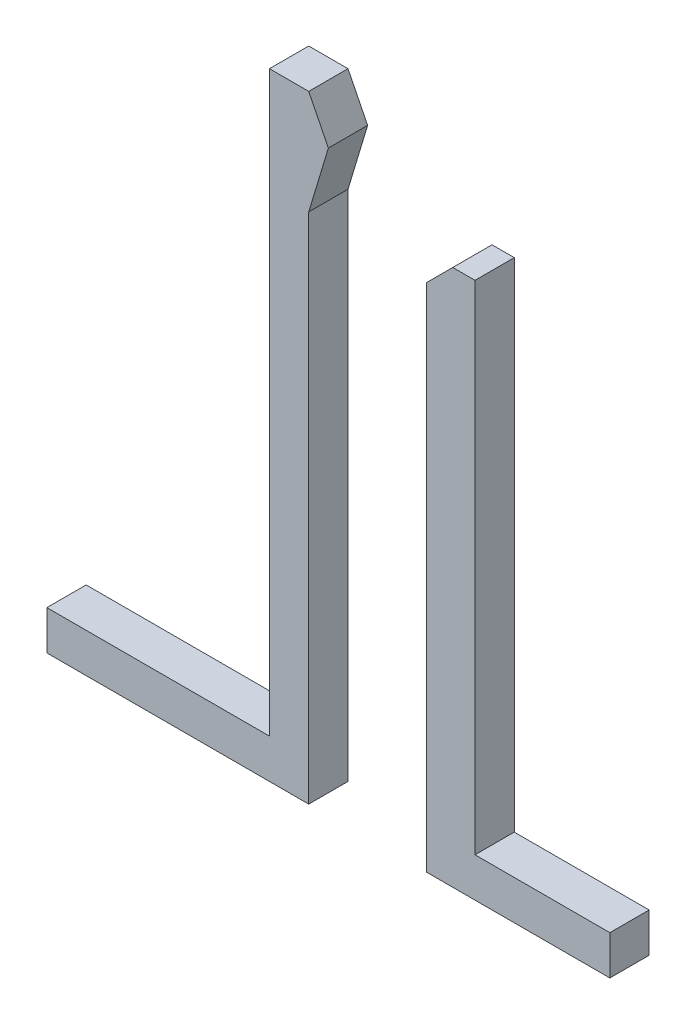
ISO-10303-21;
HEADER;
FILE_DESCRIPTION(('STEP AP214'),'2;1');
FILE_NAME('part.step','',(''),(''),'','','');
FILE_SCHEMA(('AUTOMOTIVE_DESIGN { 1 0 10303 214 1 1 1 1 }'));
ENDSEC;
DATA;
#1=APPLICATION_CONTEXT('core data for automotive mechanical design processes');
#2=APPLICATION_PROTOCOL_DEFINITION('international standard','automotive_design',2000,#1);
#3=PRODUCT_CONTEXT('',#1,'mechanical');
#4=PRODUCT('Part','Part','',(#3));
#5=PRODUCT_RELATED_PRODUCT_CATEGORY('part','',(#4));
#6=PRODUCT_DEFINITION_FORMATION('','',#4);
#7=PRODUCT_DEFINITION_CONTEXT('part definition',#1,'design');
#8=PRODUCT_DEFINITION('design','',#6,#7);
#9=PRODUCT_DEFINITION_SHAPE('','',#8);
#10=(LENGTH_UNIT() NAMED_UNIT(*) SI_UNIT(.MILLI.,.METRE.));
#11=(NAMED_UNIT(*) PLANE_ANGLE_UNIT() SI_UNIT($,.RADIAN.));
#12=(NAMED_UNIT(*) SI_UNIT($,.STERADIAN.) SOLID_ANGLE_UNIT());
#13=UNCERTAINTY_MEASURE_WITH_UNIT(LENGTH_MEASURE(1.E-05),#10,'distance_accuracy_value','');
#14=(GEOMETRIC_REPRESENTATION_CONTEXT(3) GLOBAL_UNCERTAINTY_ASSIGNED_CONTEXT((#13)) GLOBAL_UNIT_ASSIGNED_CONTEXT((#10,
#11,#12)) REPRESENTATION_CONTEXT('',''));
#15=CARTESIAN_POINT('',(0.,0.,0.));
#16=DIRECTION('',(0.,0.,1.));
#17=DIRECTION('',(1.,0.,0.));
#18=AXIS2_PLACEMENT_3D('',#15,#16,#17);
#19=CARTESIAN_POINT('',(1.95,0.2,0.3));
#20=DIRECTION('',(-1.,0.,0.));
#21=DIRECTION('',(0.,0.,1.));
#22=AXIS2_PLACEMENT_3D('',#19,#20,#21);
#23=PLANE('',#22);
#24=DIRECTION('',(0.,1.,0.));
#25=VECTOR('',#24,1.);
#26=CARTESIAN_POINT('',(1.95,0.2,0.));
#27=LINE('',#26,#25);
#28=CARTESIAN_POINT('',(1.95,-0.1,0.));
#29=VERTEX_POINT('',#28);
#30=CARTESIAN_POINT('',(1.95,0.2,0.));
#31=VERTEX_POINT('',#30);
#32=EDGE_CURVE('E134',#29,#31,#27,.T.);
#33=ORIENTED_EDGE('',*,*,#32,.T.);
#34=DIRECTION('',(0.,0.,-1.));
#35=VECTOR('',#34,1.);
#36=CARTESIAN_POINT('',(1.95,0.2,0.3));
#37=LINE('',#36,#35);
#38=CARTESIAN_POINT('',(1.95,0.2,0.3));
#39=VERTEX_POINT('',#38);
#40=EDGE_CURVE('E12',#39,#31,#37,.T.);
#41=ORIENTED_EDGE('',*,*,#40,.F.);
#42=DIRECTION('',(0.,1.,0.));
#43=VECTOR('',#42,1.);
#44=CARTESIAN_POINT('',(1.95,0.2,0.3));
#45=LINE('',#44,#43);
#46=CARTESIAN_POINT('',(1.95,-0.1,0.3));
#47=VERTEX_POINT('',#46);
#48=EDGE_CURVE('E146',#47,#39,#45,.T.);
#49=ORIENTED_EDGE('',*,*,#48,.F.);
#50=DIRECTION('',(0.,0.,-1.));
#51=VECTOR('',#50,1.);
#52=CARTESIAN_POINT('',(1.95,-0.1,0.3));
#53=LINE('',#52,#51);
#54=EDGE_CURVE('E130',#47,#29,#53,.T.);
#55=ORIENTED_EDGE('',*,*,#54,.T.);
#56=EDGE_LOOP('',(#33,#41,#49,#55));
#57=FACE_BOUND('',#56,.T.);
#58=ADVANCED_FACE('F44',(#57),#23,.F.);
#59=CARTESIAN_POINT('',(0.92,0.2,0.3));
#60=DIRECTION('',(0.,-1.,0.));
#61=DIRECTION('',(0.,0.,-1.));
#62=AXIS2_PLACEMENT_3D('',#59,#60,#61);
#63=PLANE('',#62);
#64=DIRECTION('',(-1.,0.,0.));
#65=VECTOR('',#64,1.);
#66=CARTESIAN_POINT('',(0.92,0.2,0.));
#67=LINE('',#66,#65);
#68=CARTESIAN_POINT('',(0.92,0.2,0.));
#69=VERTEX_POINT('',#68);
#70=EDGE_CURVE('E137',#31,#69,#67,.T.);
#71=ORIENTED_EDGE('',*,*,#70,.T.);
#72=DIRECTION('',(0.,0.,-1.));
#73=VECTOR('',#72,1.);
#74=CARTESIAN_POINT('',(0.92,0.2,0.3));
#75=LINE('',#74,#73);
#76=CARTESIAN_POINT('',(0.92,0.2,0.3));
#77=VERTEX_POINT('',#76);
#78=EDGE_CURVE('E52',#77,#69,#75,.T.);
#79=ORIENTED_EDGE('',*,*,#78,.F.);
#80=DIRECTION('',(-1.,0.,0.));
#81=VECTOR('',#80,1.);
#82=CARTESIAN_POINT('',(0.92,0.2,0.3));
#83=LINE('',#82,#81);
#84=EDGE_CURVE('E100',#39,#77,#83,.T.);
#85=ORIENTED_EDGE('',*,*,#84,.F.);
#86=ORIENTED_EDGE('',*,*,#40,.T.);
#87=EDGE_LOOP('',(#71,#79,#85,#86));
#88=FACE_BOUND('',#87,.T.);
#89=ADVANCED_FACE('F171',(#88),#63,.F.);
#90=CARTESIAN_POINT('',(0.92,4.,0.3));
#91=DIRECTION('',(-1.,0.,0.));
#92=DIRECTION('',(0.,-1.,0.));
#93=AXIS2_PLACEMENT_3D('',#90,#91,#92);
#94=PLANE('',#93);
#95=DIRECTION('',(0.,1.,0.));
#96=VECTOR('',#95,1.);
#97=CARTESIAN_POINT('',(0.92,4.,0.));
#98=LINE('',#97,#96);
#99=CARTESIAN_POINT('',(0.92,4.,0.));
#100=VERTEX_POINT('',#99);
#101=EDGE_CURVE('E139',#69,#100,#98,.T.);
#102=ORIENTED_EDGE('',*,*,#101,.T.);
#103=DIRECTION('',(0.,0.,-1.));
#104=VECTOR('',#103,1.);
#105=CARTESIAN_POINT('',(0.92,4.,0.3));
#106=LINE('',#105,#104);
#107=CARTESIAN_POINT('',(0.92,4.,0.3));
#108=VERTEX_POINT('',#107);
#109=EDGE_CURVE('E150',#108,#100,#106,.T.);
#110=ORIENTED_EDGE('',*,*,#109,.F.);
#111=DIRECTION('',(0.,1.,0.));
#112=VECTOR('',#111,1.);
#113=CARTESIAN_POINT('',(0.92,4.,0.3));
#114=LINE('',#113,#112);
#115=EDGE_CURVE('E158',#77,#108,#114,.T.);
#116=ORIENTED_EDGE('',*,*,#115,.F.);
#117=ORIENTED_EDGE('',*,*,#78,.T.);
#118=EDGE_LOOP('',(#102,#110,#116,#117));
#119=FACE_BOUND('',#118,.T.);
#120=ADVANCED_FACE('F156',(#119),#94,.F.);
#121=CARTESIAN_POINT('',(0.75,4.,0.3));
#122=DIRECTION('',(0.,-1.,0.));
#123=DIRECTION('',(0.,0.,-1.));
#124=AXIS2_PLACEMENT_3D('',#121,#122,#123);
#125=PLANE('',#124);
#126=DIRECTION('',(-1.,0.,0.));
#127=VECTOR('',#126,1.);
#128=CARTESIAN_POINT('',(0.75,4.,0.));
#129=LINE('',#128,#127);
#130=CARTESIAN_POINT('',(0.75,4.,0.));
#131=VERTEX_POINT('',#130);
#132=EDGE_CURVE('E141',#100,#131,#129,.T.);
#133=ORIENTED_EDGE('',*,*,#132,.T.);
#134=DIRECTION('',(0.,0.,-1.));
#135=VECTOR('',#134,1.);
#136=CARTESIAN_POINT('',(0.75,4.,0.3));
#137=LINE('',#136,#135);
#138=CARTESIAN_POINT('',(0.75,4.,0.3));
#139=VERTEX_POINT('',#138);
#140=EDGE_CURVE('E125',#139,#131,#137,.T.);
#141=ORIENTED_EDGE('',*,*,#140,.F.);
#142=DIRECTION('',(-1.,0.,0.));
#143=VECTOR('',#142,1.);
#144=CARTESIAN_POINT('',(0.75,4.,0.3));
#145=LINE('',#144,#143);
#146=EDGE_CURVE('E116',#108,#139,#145,.T.);
#147=ORIENTED_EDGE('',*,*,#146,.F.);
#148=ORIENTED_EDGE('',*,*,#109,.T.);
#149=EDGE_LOOP('',(#133,#141,#147,#148));
#150=FACE_BOUND('',#149,.T.);
#151=ADVANCED_FACE('F164',(#150),#125,.F.);
#152=CARTESIAN_POINT('',(0.55,3.8,0.3));
#153=DIRECTION('',(0.707106781186548,-0.707106781186547,0.));
#154=DIRECTION('',(0.707106781186547,0.707106781186548,0.));
#155=AXIS2_PLACEMENT_3D('',#152,#153,#154);
#156=PLANE('',#155);
#157=DIRECTION('',(-0.707106781186547,-0.707106781186548,0.));
#158=VECTOR('',#157,1.);
#159=CARTESIAN_POINT('',(0.55,3.8,0.));
#160=LINE('',#159,#158);
#161=CARTESIAN_POINT('',(0.55,3.8,0.));
#162=VERTEX_POINT('',#161);
#163=EDGE_CURVE('E124',#131,#162,#160,.T.);
#164=ORIENTED_EDGE('',*,*,#163,.T.);
#165=DIRECTION('',(0.,0.,-1.));
#166=VECTOR('',#165,1.);
#167=CARTESIAN_POINT('',(0.55,3.8,0.3));
#168=LINE('',#167,#166);
#169=CARTESIAN_POINT('',(0.55,3.8,0.3));
#170=VERTEX_POINT('',#169);
#171=EDGE_CURVE('E121',#170,#162,#168,.T.);
#172=ORIENTED_EDGE('',*,*,#171,.F.);
#173=DIRECTION('',(-0.707106781186547,-0.707106781186548,0.));
#174=VECTOR('',#173,1.);
#175=CARTESIAN_POINT('',(0.55,3.8,0.3));
#176=LINE('',#175,#174);
#177=EDGE_CURVE('E110',#139,#170,#176,.T.);
#178=ORIENTED_EDGE('',*,*,#177,.F.);
#179=ORIENTED_EDGE('',*,*,#140,.T.);
#180=EDGE_LOOP('',(#164,#172,#178,#179));
#181=FACE_BOUND('',#180,.T.);
#182=ADVANCED_FACE('F122',(#181),#156,.F.);
#183=CARTESIAN_POINT('',(0.55,-0.1,0.3));
#184=DIRECTION('',(1.,0.,0.));
#185=DIRECTION('',(0.,0.,-1.));
#186=AXIS2_PLACEMENT_3D('',#183,#184,#185);
#187=PLANE('',#186);
#188=DIRECTION('',(0.,-1.,0.));
#189=VECTOR('',#188,1.);
#190=CARTESIAN_POINT('',(0.55,-0.1,0.));
#191=LINE('',#190,#189);
#192=CARTESIAN_POINT('',(0.55,-0.1,0.));
#193=VERTEX_POINT('',#192);
#194=EDGE_CURVE('E86',#162,#193,#191,.T.);
#195=ORIENTED_EDGE('',*,*,#194,.T.);
#196=DIRECTION('',(0.,0.,-1.));
#197=VECTOR('',#196,1.);
#198=CARTESIAN_POINT('',(0.55,-0.1,0.3));
#199=LINE('',#198,#197);
#200=CARTESIAN_POINT('',(0.55,-0.1,0.3));
#201=VERTEX_POINT('',#200);
#202=EDGE_CURVE('E126',#201,#193,#199,.T.);
#203=ORIENTED_EDGE('',*,*,#202,.F.);
#204=DIRECTION('',(0.,-1.,0.));
#205=VECTOR('',#204,1.);
#206=CARTESIAN_POINT('',(0.55,-0.1,0.3));
#207=LINE('',#206,#205);
#208=EDGE_CURVE('E114',#170,#201,#207,.T.);
#209=ORIENTED_EDGE('',*,*,#208,.F.);
#210=ORIENTED_EDGE('',*,*,#171,.T.);
#211=EDGE_LOOP('',(#195,#203,#209,#210));
#212=FACE_BOUND('',#211,.T.);
#213=ADVANCED_FACE('F128',(#212),#187,.F.);
#214=CARTESIAN_POINT('',(1.95,-0.1,0.3));
#215=DIRECTION('',(0.,1.,0.));
#216=DIRECTION('',(-1.,0.,0.));
#217=AXIS2_PLACEMENT_3D('',#214,#215,#216);
#218=PLANE('',#217);
#219=DIRECTION('',(1.,0.,0.));
#220=VECTOR('',#219,1.);
#221=CARTESIAN_POINT('',(1.95,-0.1,0.));
#222=LINE('',#221,#220);
#223=EDGE_CURVE('E92',#193,#29,#222,.T.);
#224=ORIENTED_EDGE('',*,*,#223,.T.);
#225=ORIENTED_EDGE('',*,*,#54,.F.);
#226=DIRECTION('',(1.,0.,0.));
#227=VECTOR('',#226,1.);
#228=CARTESIAN_POINT('',(1.95,-0.1,0.3));
#229=LINE('',#228,#227);
#230=EDGE_CURVE('E60',#201,#47,#229,.T.);
#231=ORIENTED_EDGE('',*,*,#230,.F.);
#232=ORIENTED_EDGE('',*,*,#202,.T.);
#233=EDGE_LOOP('',(#224,#225,#231,#232));
#234=FACE_BOUND('',#233,.T.);
#235=ADVANCED_FACE('F185',(#234),#218,.F.);
#236=CARTESIAN_POINT('',(0.,0.,0.3));
#237=DIRECTION('',(0.,0.,-1.));
#238=DIRECTION('',(-1.,0.,0.));
#239=AXIS2_PLACEMENT_3D('',#236,#237,#238);
#240=PLANE('',#239);
#241=ORIENTED_EDGE('',*,*,#48,.T.);
#242=ORIENTED_EDGE('',*,*,#84,.T.);
#243=ORIENTED_EDGE('',*,*,#115,.T.);
#244=ORIENTED_EDGE('',*,*,#146,.T.);
#245=ORIENTED_EDGE('',*,*,#177,.T.);
#246=ORIENTED_EDGE('',*,*,#208,.T.);
#247=ORIENTED_EDGE('',*,*,#230,.T.);
#248=EDGE_LOOP('',(#241,#242,#243,#244,#245,#246,#247));
#249=FACE_BOUND('',#248,.T.);
#250=ADVANCED_FACE('F112',(#249),#240,.F.);
#251=CARTESIAN_POINT('',(0.,0.,0.));
#252=DIRECTION('',(0.,0.,-1.));
#253=DIRECTION('',(-1.,0.,0.));
#254=AXIS2_PLACEMENT_3D('',#251,#252,#253);
#255=PLANE('',#254);
#256=ORIENTED_EDGE('',*,*,#32,.F.);
#257=ORIENTED_EDGE('',*,*,#223,.F.);
#258=ORIENTED_EDGE('',*,*,#194,.F.);
#259=ORIENTED_EDGE('',*,*,#163,.F.);
#260=ORIENTED_EDGE('',*,*,#132,.F.);
#261=ORIENTED_EDGE('',*,*,#101,.F.);
#262=ORIENTED_EDGE('',*,*,#70,.F.);
#263=EDGE_LOOP('',(#256,#257,#258,#259,#260,#261,#262));
#264=FACE_BOUND('',#263,.T.);
#265=ADVANCED_FACE('F162',(#264),#255,.T.);
#266=CLOSED_SHELL('',(#58,#89,#120,#151,#182,#213,#235,#250,#265));
#267=MANIFOLD_SOLID_BREP('B2',#266);
#268=CARTESIAN_POINT('',(-2.35,0.2,0.3));
#269=DIRECTION('',(1.,0.,0.));
#270=DIRECTION('',(0.,0.,-1.));
#271=AXIS2_PLACEMENT_3D('',#268,#269,#270);
#272=PLANE('',#271);
#273=DIRECTION('',(0.,-1.,0.));
#274=VECTOR('',#273,1.);
#275=CARTESIAN_POINT('',(-2.35,0.2,0.));
#276=LINE('',#275,#274);
#277=CARTESIAN_POINT('',(-2.35,0.2,0.));
#278=VERTEX_POINT('',#277);
#279=CARTESIAN_POINT('',(-2.35,-0.1,0.));
#280=VERTEX_POINT('',#279);
#281=EDGE_CURVE('E341',#278,#280,#276,.T.);
#282=ORIENTED_EDGE('',*,*,#281,.T.);
#283=DIRECTION('',(0.,0.,-1.));
#284=VECTOR('',#283,1.);
#285=CARTESIAN_POINT('',(-2.35,-0.1,0.3));
#286=LINE('',#285,#284);
#287=CARTESIAN_POINT('',(-2.35,-0.1,0.3));
#288=VERTEX_POINT('',#287);
#289=EDGE_CURVE('E42',#288,#280,#286,.T.);
#290=ORIENTED_EDGE('',*,*,#289,.F.);
#291=DIRECTION('',(0.,-1.,0.));
#292=VECTOR('',#291,1.);
#293=CARTESIAN_POINT('',(-2.35,0.2,0.3));
#294=LINE('',#293,#292);
#295=CARTESIAN_POINT('',(-2.35,0.2,0.3));
#296=VERTEX_POINT('',#295);
#297=EDGE_CURVE('E355',#296,#288,#294,.T.);
#298=ORIENTED_EDGE('',*,*,#297,.F.);
#299=DIRECTION('',(0.,0.,-1.));
#300=VECTOR('',#299,1.);
#301=CARTESIAN_POINT('',(-2.35,0.2,0.3));
#302=LINE('',#301,#300);
#303=EDGE_CURVE('E337',#296,#278,#302,.T.);
#304=ORIENTED_EDGE('',*,*,#303,.T.);
#305=EDGE_LOOP('',(#282,#290,#298,#304));
#306=FACE_BOUND('',#305,.T.);
#307=ADVANCED_FACE('F245',(#306),#272,.F.);
#308=CARTESIAN_POINT('',(-2.35,-0.1,0.3));
#309=DIRECTION('',(0.,1.,0.));
#310=DIRECTION('',(0.,0.,1.));
#311=AXIS2_PLACEMENT_3D('',#308,#309,#310);
#312=PLANE('',#311);
#313=DIRECTION('',(1.,0.,0.));
#314=VECTOR('',#313,1.);
#315=CARTESIAN_POINT('',(-2.35,-0.1,0.));
#316=LINE('',#315,#314);
#317=CARTESIAN_POINT('',(-0.35,-0.1,0.));
#318=VERTEX_POINT('',#317);
#319=EDGE_CURVE('E344',#280,#318,#316,.T.);
#320=ORIENTED_EDGE('',*,*,#319,.T.);
#321=DIRECTION('',(0.,0.,-1.));
#322=VECTOR('',#321,1.);
#323=CARTESIAN_POINT('',(-0.35,-0.1,0.3));
#324=LINE('',#323,#322);
#325=CARTESIAN_POINT('',(-0.35,-0.1,0.3));
#326=VERTEX_POINT('',#325);
#327=EDGE_CURVE('E253',#326,#318,#324,.T.);
#328=ORIENTED_EDGE('',*,*,#327,.F.);
#329=DIRECTION('',(1.,0.,0.));
#330=VECTOR('',#329,1.);
#331=CARTESIAN_POINT('',(-2.35,-0.1,0.3));
#332=LINE('',#331,#330);
#333=EDGE_CURVE('E304',#288,#326,#332,.T.);
#334=ORIENTED_EDGE('',*,*,#333,.F.);
#335=ORIENTED_EDGE('',*,*,#289,.T.);
#336=EDGE_LOOP('',(#320,#328,#334,#335));
#337=FACE_BOUND('',#336,.T.);
#338=ADVANCED_FACE('F390',(#337),#312,.F.);
#339=CARTESIAN_POINT('',(-0.35,-0.1,0.3));
#340=DIRECTION('',(-1.,0.,0.));
#341=DIRECTION('',(0.,0.,1.));
#342=AXIS2_PLACEMENT_3D('',#339,#340,#341);
#343=PLANE('',#342);
#344=DIRECTION('',(0.,1.,0.));
#345=VECTOR('',#344,1.);
#346=CARTESIAN_POINT('',(-0.35,-0.1,0.));
#347=LINE('',#346,#345);
#348=CARTESIAN_POINT('',(-0.35,3.81740715259392,0.));
#349=VERTEX_POINT('',#348);
#350=EDGE_CURVE('E346',#318,#349,#347,.T.);
#351=ORIENTED_EDGE('',*,*,#350,.T.);
#352=DIRECTION('',(0.,0.,-1.));
#353=VECTOR('',#352,1.);
#354=CARTESIAN_POINT('',(-0.35,3.81740715259392,0.3));
#355=LINE('',#354,#353);
#356=CARTESIAN_POINT('',(-0.35,3.81740715259392,0.3));
#357=VERTEX_POINT('',#356);
#358=EDGE_CURVE('E362',#357,#349,#355,.T.);
#359=ORIENTED_EDGE('',*,*,#358,.F.);
#360=DIRECTION('',(0.,1.,0.));
#361=VECTOR('',#360,1.);
#362=CARTESIAN_POINT('',(-0.35,-0.1,0.3));
#363=LINE('',#362,#361);
#364=EDGE_CURVE('E370',#326,#357,#363,.T.);
#365=ORIENTED_EDGE('',*,*,#364,.F.);
#366=ORIENTED_EDGE('',*,*,#327,.T.);
#367=EDGE_LOOP('',(#351,#359,#365,#366));
#368=FACE_BOUND('',#367,.T.);
#369=ADVANCED_FACE('F368',(#368),#343,.F.);
#370=CARTESIAN_POINT('',(-0.2,4.31481667929813,0.3));
#371=DIRECTION('',(-0.957413602339711,0.288719923203956,0.));
#372=DIRECTION('',(-0.288719923203956,-0.957413602339711,0.));
#373=AXIS2_PLACEMENT_3D('',#370,#371,#372);
#374=PLANE('',#373);
#375=DIRECTION('',(0.288719923203956,0.957413602339711,0.));
#376=VECTOR('',#375,1.);
#377=CARTESIAN_POINT('',(-0.2,4.31481667929813,0.));
#378=LINE('',#377,#376);
#379=CARTESIAN_POINT('',(-0.2,4.31481667929813,0.));
#380=VERTEX_POINT('',#379);
#381=EDGE_CURVE('E348',#349,#380,#378,.T.);
#382=ORIENTED_EDGE('',*,*,#381,.T.);
#383=DIRECTION('',(0.,0.,-1.));
#384=VECTOR('',#383,1.);
#385=CARTESIAN_POINT('',(-0.2,4.31481667929813,0.3));
#386=LINE('',#385,#384);
#387=CARTESIAN_POINT('',(-0.2,4.31481667929813,0.3));
#388=VERTEX_POINT('',#387);
#389=EDGE_CURVE('E359',#388,#380,#386,.T.);
#390=ORIENTED_EDGE('',*,*,#389,.F.);
#391=DIRECTION('',(0.288719923203956,0.957413602339711,0.));
#392=VECTOR('',#391,1.);
#393=CARTESIAN_POINT('',(-0.2,4.31481667929813,0.3));
#394=LINE('',#393,#392);
#395=EDGE_CURVE('E382',#357,#388,#394,.T.);
#396=ORIENTED_EDGE('',*,*,#395,.F.);
#397=ORIENTED_EDGE('',*,*,#358,.T.);
#398=EDGE_LOOP('',(#382,#390,#396,#397));
#399=FACE_BOUND('',#398,.T.);
#400=ADVANCED_FACE('F378',(#399),#374,.F.);
#401=CARTESIAN_POINT('',(-0.35,4.61481667929813,0.3));
#402=DIRECTION('',(-0.894427190999916,-0.447213595499958,0.));
#403=DIRECTION('',(0.447213595499958,-0.894427190999916,0.));
#404=AXIS2_PLACEMENT_3D('',#401,#402,#403);
#405=PLANE('',#404);
#406=DIRECTION('',(-0.447213595499958,0.894427190999916,0.));
#407=VECTOR('',#406,1.);
#408=CARTESIAN_POINT('',(-0.35,4.61481667929813,0.));
#409=LINE('',#408,#407);
#410=CARTESIAN_POINT('',(-0.35,4.61481667929813,0.));
#411=VERTEX_POINT('',#410);
#412=EDGE_CURVE('E350',#380,#411,#409,.T.);
#413=ORIENTED_EDGE('',*,*,#412,.T.);
#414=DIRECTION('',(0.,0.,-1.));
#415=VECTOR('',#414,1.);
#416=CARTESIAN_POINT('',(-0.35,4.61481667929813,0.3));
#417=LINE('',#416,#415);
#418=CARTESIAN_POINT('',(-0.35,4.61481667929813,0.3));
#419=VERTEX_POINT('',#418);
#420=EDGE_CURVE('E332',#419,#411,#417,.T.);
#421=ORIENTED_EDGE('',*,*,#420,.F.);
#422=DIRECTION('',(-0.447213595499958,0.894427190999916,0.));
#423=VECTOR('',#422,1.);
#424=CARTESIAN_POINT('',(-0.35,4.61481667929813,0.3));
#425=LINE('',#424,#423);
#426=EDGE_CURVE('E323',#388,#419,#425,.T.);
#427=ORIENTED_EDGE('',*,*,#426,.F.);
#428=ORIENTED_EDGE('',*,*,#389,.T.);
#429=EDGE_LOOP('',(#413,#421,#427,#428));
#430=FACE_BOUND('',#429,.T.);
#431=ADVANCED_FACE('F381',(#430),#405,.F.);
#432=CARTESIAN_POINT('',(-0.35,4.61481667929813,0.3));
#433=DIRECTION('',(0.,-1.,0.));
#434=DIRECTION('',(0.,0.,-1.));
#435=AXIS2_PLACEMENT_3D('',#432,#433,#434);
#436=PLANE('',#435);
#437=DIRECTION('',(-1.,0.,0.));
#438=VECTOR('',#437,1.);
#439=CARTESIAN_POINT('',(-0.35,4.61481667929813,0.));
#440=LINE('',#439,#438);
#441=CARTESIAN_POINT('',(-0.65,4.61481667929813,0.));
#442=VERTEX_POINT('',#441);
#443=EDGE_CURVE('E331',#411,#442,#440,.T.);
#444=ORIENTED_EDGE('',*,*,#443,.T.);
#445=DIRECTION('',(0.,0.,-1.));
#446=VECTOR('',#445,1.);
#447=CARTESIAN_POINT('',(-0.65,4.61481667929813,0.3));
#448=LINE('',#447,#446);
#449=CARTESIAN_POINT('',(-0.65,4.61481667929813,0.3));
#450=VERTEX_POINT('',#449);
#451=EDGE_CURVE('E328',#450,#442,#448,.T.);
#452=ORIENTED_EDGE('',*,*,#451,.F.);
#453=DIRECTION('',(-1.,0.,0.));
#454=VECTOR('',#453,1.);
#455=CARTESIAN_POINT('',(-0.35,4.61481667929813,0.3));
#456=LINE('',#455,#454);
#457=EDGE_CURVE('E317',#419,#450,#456,.T.);
#458=ORIENTED_EDGE('',*,*,#457,.F.);
#459=ORIENTED_EDGE('',*,*,#420,.T.);
#460=EDGE_LOOP('',(#444,#452,#458,#459));
#461=FACE_BOUND('',#460,.T.);
#462=ADVANCED_FACE('F329',(#461),#436,.F.);
#463=CARTESIAN_POINT('',(-0.65,4.61481667929813,0.3));
#464=DIRECTION('',(1.,0.,0.));
#465=DIRECTION('',(0.,1.,0.));
#466=AXIS2_PLACEMENT_3D('',#463,#464,#465);
#467=PLANE('',#466);
#468=DIRECTION('',(0.,-1.,0.));
#469=VECTOR('',#468,1.);
#470=CARTESIAN_POINT('',(-0.65,4.61481667929813,0.));
#471=LINE('',#470,#469);
#472=CARTESIAN_POINT('',(-0.65,0.2,0.));
#473=VERTEX_POINT('',#472);
#474=EDGE_CURVE('E290',#442,#473,#471,.T.);
#475=ORIENTED_EDGE('',*,*,#474,.T.);
#476=DIRECTION('',(0.,0.,-1.));
#477=VECTOR('',#476,1.);
#478=CARTESIAN_POINT('',(-0.65,0.2,0.3));
#479=LINE('',#478,#477);
#480=CARTESIAN_POINT('',(-0.65,0.2,0.3));
#481=VERTEX_POINT('',#480);
#482=EDGE_CURVE('E333',#481,#473,#479,.T.);
#483=ORIENTED_EDGE('',*,*,#482,.F.);
#484=DIRECTION('',(0.,-1.,0.));
#485=VECTOR('',#484,1.);
#486=CARTESIAN_POINT('',(-0.65,4.61481667929813,0.3));
#487=LINE('',#486,#485);
#488=EDGE_CURVE('E321',#450,#481,#487,.T.);
#489=ORIENTED_EDGE('',*,*,#488,.F.);
#490=ORIENTED_EDGE('',*,*,#451,.T.);
#491=EDGE_LOOP('',(#475,#483,#489,#490));
#492=FACE_BOUND('',#491,.T.);
#493=ADVANCED_FACE('F335',(#492),#467,.F.);
#494=CARTESIAN_POINT('',(-0.65,0.2,0.3));
#495=DIRECTION('',(0.,-1.,0.));
#496=DIRECTION('',(1.,0.,0.));
#497=AXIS2_PLACEMENT_3D('',#494,#495,#496);
#498=PLANE('',#497);
#499=DIRECTION('',(-1.,0.,0.));
#500=VECTOR('',#499,1.);
#501=CARTESIAN_POINT('',(-0.65,0.2,0.));
#502=LINE('',#501,#500);
#503=EDGE_CURVE('E296',#473,#278,#502,.T.);
#504=ORIENTED_EDGE('',*,*,#503,.T.);
#505=ORIENTED_EDGE('',*,*,#303,.F.);
#506=DIRECTION('',(-1.,0.,0.));
#507=VECTOR('',#506,1.);
#508=CARTESIAN_POINT('',(-0.65,0.2,0.3));
#509=LINE('',#508,#507);
#510=EDGE_CURVE('E261',#481,#296,#509,.T.);
#511=ORIENTED_EDGE('',*,*,#510,.F.);
#512=ORIENTED_EDGE('',*,*,#482,.T.);
#513=EDGE_LOOP('',(#504,#505,#511,#512));
#514=FACE_BOUND('',#513,.T.);
#515=ADVANCED_FACE('F406',(#514),#498,.F.);
#516=CARTESIAN_POINT('',(0.,0.,0.3));
#517=DIRECTION('',(0.,0.,1.));
#518=DIRECTION('',(1.,0.,0.));
#519=AXIS2_PLACEMENT_3D('',#516,#517,#518);
#520=PLANE('',#519);
#521=ORIENTED_EDGE('',*,*,#297,.T.);
#522=ORIENTED_EDGE('',*,*,#333,.T.);
#523=ORIENTED_EDGE('',*,*,#364,.T.);
#524=ORIENTED_EDGE('',*,*,#395,.T.);
#525=ORIENTED_EDGE('',*,*,#426,.T.);
#526=ORIENTED_EDGE('',*,*,#457,.T.);
#527=ORIENTED_EDGE('',*,*,#488,.T.);
#528=ORIENTED_EDGE('',*,*,#510,.T.);
#529=EDGE_LOOP('',(#521,#522,#523,#524,#525,#526,#527,#528));
#530=FACE_BOUND('',#529,.T.);
#531=ADVANCED_FACE('F319',(#530),#520,.T.);
#532=CARTESIAN_POINT('',(0.,0.,0.));
#533=DIRECTION('',(0.,0.,1.));
#534=DIRECTION('',(1.,0.,0.));
#535=AXIS2_PLACEMENT_3D('',#532,#533,#534);
#536=PLANE('',#535);
#537=ORIENTED_EDGE('',*,*,#281,.F.);
#538=ORIENTED_EDGE('',*,*,#503,.F.);
#539=ORIENTED_EDGE('',*,*,#474,.F.);
#540=ORIENTED_EDGE('',*,*,#443,.F.);
#541=ORIENTED_EDGE('',*,*,#412,.F.);
#542=ORIENTED_EDGE('',*,*,#381,.F.);
#543=ORIENTED_EDGE('',*,*,#350,.F.);
#544=ORIENTED_EDGE('',*,*,#319,.F.);
#545=EDGE_LOOP('',(#537,#538,#539,#540,#541,#542,#543,#544));
#546=FACE_BOUND('',#545,.T.);
#547=ADVANCED_FACE('F374',(#546),#536,.F.);
#548=CLOSED_SHELL('',(#307,#338,#369,#400,#431,#462,#493,#515,#531,#547));
#549=MANIFOLD_SOLID_BREP('B6',#548);
#550=ADVANCED_BREP_SHAPE_REPRESENTATION('',(#18,#267,#549),#14);
#551=SHAPE_DEFINITION_REPRESENTATION(#9,#550);
ENDSEC;
END-ISO-10303-21;
